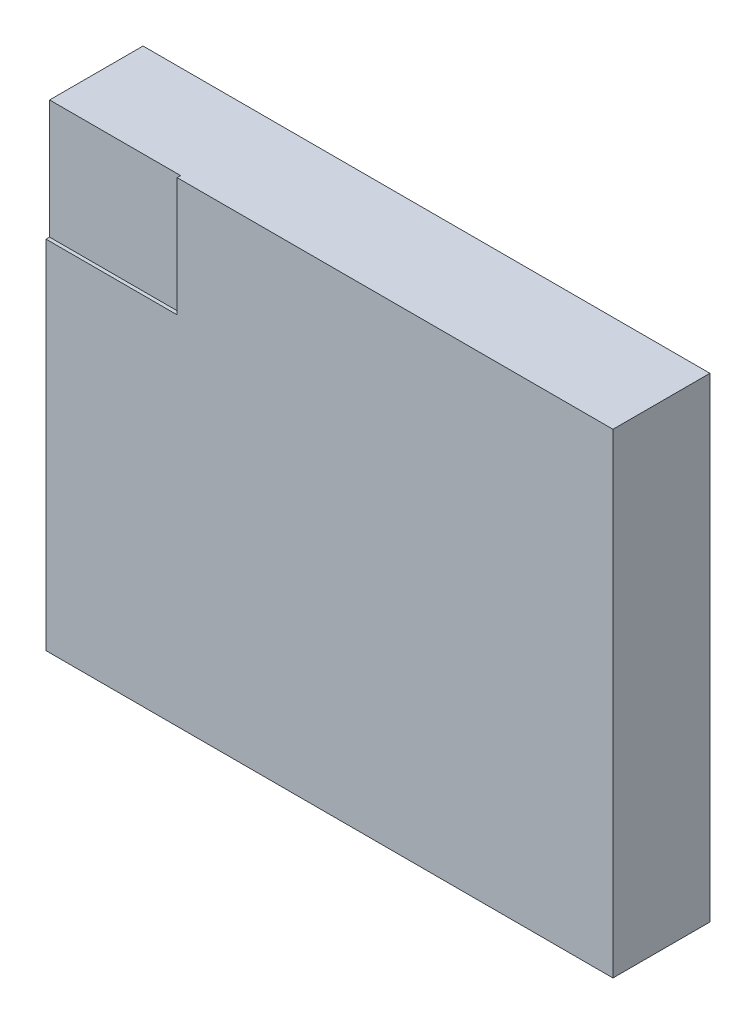
ISO-10303-21;
HEADER;
FILE_DESCRIPTION(('STEP AP214'),'2;1');
FILE_NAME('part.step','',(''),(''),'','','');
FILE_SCHEMA(('AUTOMOTIVE_DESIGN { 1 0 10303 214 1 1 1 1 }'));
ENDSEC;
DATA;
#1=APPLICATION_CONTEXT('core data for automotive mechanical design processes');
#2=APPLICATION_PROTOCOL_DEFINITION('international standard','automotive_design',2000,#1);
#3=PRODUCT_CONTEXT('',#1,'mechanical');
#4=PRODUCT('Part','Part','',(#3));
#5=PRODUCT_RELATED_PRODUCT_CATEGORY('part','',(#4));
#6=PRODUCT_DEFINITION_FORMATION('','',#4);
#7=PRODUCT_DEFINITION_CONTEXT('part definition',#1,'design');
#8=PRODUCT_DEFINITION('design','',#6,#7);
#9=PRODUCT_DEFINITION_SHAPE('','',#8);
#10=(LENGTH_UNIT() NAMED_UNIT(*) SI_UNIT(.MILLI.,.METRE.));
#11=(NAMED_UNIT(*) PLANE_ANGLE_UNIT() SI_UNIT($,.RADIAN.));
#12=(NAMED_UNIT(*) SI_UNIT($,.STERADIAN.) SOLID_ANGLE_UNIT());
#13=UNCERTAINTY_MEASURE_WITH_UNIT(LENGTH_MEASURE(1.E-05),#10,'distance_accuracy_value','');
#14=(GEOMETRIC_REPRESENTATION_CONTEXT(3) GLOBAL_UNCERTAINTY_ASSIGNED_CONTEXT((#13)) GLOBAL_UNIT_ASSIGNED_CONTEXT((#10,
#11,#12)) REPRESENTATION_CONTEXT('',''));
#15=CARTESIAN_POINT('',(0.,0.,0.));
#16=DIRECTION('',(0.,0.,1.));
#17=DIRECTION('',(1.,0.,0.));
#18=AXIS2_PLACEMENT_3D('',#15,#16,#17);
#19=CARTESIAN_POINT('',(-0.804,-0.674,0.439));
#20=DIRECTION('',(0.,1.,0.));
#21=DIRECTION('',(0.,0.,1.));
#22=AXIS2_PLACEMENT_3D('',#19,#20,#21);
#23=PLANE('',#22);
#24=DIRECTION('',(1.,0.,0.));
#25=VECTOR('',#24,1.);
#26=CARTESIAN_POINT('',(-0.804,-0.674,0.164));
#27=LINE('',#26,#25);
#28=CARTESIAN_POINT('',(-0.804,-0.674,0.164));
#29=VERTEX_POINT('',#28);
#30=CARTESIAN_POINT('',(0.804,-0.674,0.164));
#31=VERTEX_POINT('',#30);
#32=EDGE_CURVE('E153',#29,#31,#27,.T.);
#33=ORIENTED_EDGE('',*,*,#32,.T.);
#34=DIRECTION('',(0.,0.,-1.));
#35=VECTOR('',#34,1.);
#36=CARTESIAN_POINT('',(0.804,-0.674,0.439));
#37=LINE('',#36,#35);
#38=CARTESIAN_POINT('',(0.804,-0.674,0.439));
#39=VERTEX_POINT('',#38);
#40=EDGE_CURVE('E175',#39,#31,#37,.T.);
#41=ORIENTED_EDGE('',*,*,#40,.F.);
#42=DIRECTION('',(1.,0.,0.));
#43=VECTOR('',#42,1.);
#44=CARTESIAN_POINT('',(-0.804,-0.674,0.439));
#45=LINE('',#44,#43);
#46=CARTESIAN_POINT('',(-0.804,-0.674,0.439));
#47=VERTEX_POINT('',#46);
#48=EDGE_CURVE('E142',#47,#39,#45,.T.);
#49=ORIENTED_EDGE('',*,*,#48,.F.);
#50=DIRECTION('',(0.,0.,-1.));
#51=VECTOR('',#50,1.);
#52=CARTESIAN_POINT('',(-0.804,-0.674,0.439));
#53=LINE('',#52,#51);
#54=EDGE_CURVE('E65',#47,#29,#53,.T.);
#55=ORIENTED_EDGE('',*,*,#54,.T.);
#56=EDGE_LOOP('',(#33,#41,#49,#55));
#57=FACE_BOUND('',#56,.T.);
#58=ADVANCED_FACE('F41',(#57),#23,.F.);
#59=CARTESIAN_POINT('',(0.804,-0.674,0.439));
#60=DIRECTION('',(-1.,0.,0.));
#61=DIRECTION('',(0.,0.,1.));
#62=AXIS2_PLACEMENT_3D('',#59,#60,#61);
#63=PLANE('',#62);
#64=DIRECTION('',(0.,1.,0.));
#65=VECTOR('',#64,1.);
#66=CARTESIAN_POINT('',(0.804,-0.674,0.164));
#67=LINE('',#66,#65);
#68=CARTESIAN_POINT('',(0.804,0.674,0.164));
#69=VERTEX_POINT('',#68);
#70=EDGE_CURVE('E156',#31,#69,#67,.T.);
#71=ORIENTED_EDGE('',*,*,#70,.T.);
#72=DIRECTION('',(0.,0.,-1.));
#73=VECTOR('',#72,1.);
#74=CARTESIAN_POINT('',(0.804,0.674,0.439));
#75=LINE('',#74,#73);
#76=CARTESIAN_POINT('',(0.804,0.674,0.439));
#77=VERTEX_POINT('',#76);
#78=EDGE_CURVE('E172',#77,#69,#75,.T.);
#79=ORIENTED_EDGE('',*,*,#78,.F.);
#80=DIRECTION('',(0.,1.,0.));
#81=VECTOR('',#80,1.);
#82=CARTESIAN_POINT('',(0.804,-0.674,0.439));
#83=LINE('',#82,#81);
#84=EDGE_CURVE('E90',#39,#77,#83,.T.);
#85=ORIENTED_EDGE('',*,*,#84,.F.);
#86=ORIENTED_EDGE('',*,*,#40,.T.);
#87=EDGE_LOOP('',(#71,#79,#85,#86));
#88=FACE_BOUND('',#87,.T.);
#89=ADVANCED_FACE('F231',(#88),#63,.F.);
#90=CARTESIAN_POINT('',(-0.804,0.674,0.439));
#91=DIRECTION('',(0.,1.,0.));
#92=DIRECTION('',(0.,0.,1.));
#93=AXIS2_PLACEMENT_3D('',#90,#91,#92);
#94=PLANE('',#93);
#95=DIRECTION('',(0.,0.,1.));
#96=VECTOR('',#95,1.);
#97=CARTESIAN_POINT('',(-0.432193105170204,0.674,0.429));
#98=LINE('',#97,#96);
#99=CARTESIAN_POINT('',(-0.432193105170204,0.674,0.429));
#100=VERTEX_POINT('',#99);
#101=CARTESIAN_POINT('',(-0.432193105170204,0.674,0.439));
#102=VERTEX_POINT('',#101);
#103=EDGE_CURVE('E136',#100,#102,#98,.T.);
#104=ORIENTED_EDGE('',*,*,#103,.T.);
#105=DIRECTION('',(1.,0.,0.));
#106=VECTOR('',#105,1.);
#107=CARTESIAN_POINT('',(-0.804,0.674,0.439));
#108=LINE('',#107,#106);
#109=EDGE_CURVE('E148',#102,#77,#108,.T.);
#110=ORIENTED_EDGE('',*,*,#109,.T.);
#111=ORIENTED_EDGE('',*,*,#78,.T.);
#112=DIRECTION('',(1.,0.,0.));
#113=VECTOR('',#112,1.);
#114=CARTESIAN_POINT('',(-0.804,0.674,0.164));
#115=LINE('',#114,#113);
#116=CARTESIAN_POINT('',(-0.804,0.674,0.164));
#117=VERTEX_POINT('',#116);
#118=EDGE_CURVE('E160',#117,#69,#115,.T.);
#119=ORIENTED_EDGE('',*,*,#118,.F.);
#120=DIRECTION('',(0.,0.,-1.));
#121=VECTOR('',#120,1.);
#122=CARTESIAN_POINT('',(-0.804,0.674,0.439));
#123=LINE('',#122,#121);
#124=CARTESIAN_POINT('',(-0.804,0.674,0.429));
#125=VERTEX_POINT('',#124);
#126=EDGE_CURVE('E169',#125,#117,#123,.T.);
#127=ORIENTED_EDGE('',*,*,#126,.F.);
#128=DIRECTION('',(-1.,0.,0.));
#129=VECTOR('',#128,1.);
#130=CARTESIAN_POINT('',(-0.804,0.674,0.429));
#131=LINE('',#130,#129);
#132=EDGE_CURVE('E123',#100,#125,#131,.T.);
#133=ORIENTED_EDGE('',*,*,#132,.F.);
#134=EDGE_LOOP('',(#104,#110,#111,#119,#127,#133));
#135=FACE_BOUND('',#134,.T.);
#136=ADVANCED_FACE('F229',(#135),#94,.T.);
#137=CARTESIAN_POINT('',(-0.804,-0.674,0.439));
#138=DIRECTION('',(-1.,0.,0.));
#139=DIRECTION('',(0.,0.,1.));
#140=AXIS2_PLACEMENT_3D('',#137,#138,#139);
#141=PLANE('',#140);
#142=DIRECTION('',(0.,0.,1.));
#143=VECTOR('',#142,1.);
#144=CARTESIAN_POINT('',(-0.804,0.336964115895415,0.429));
#145=LINE('',#144,#143);
#146=CARTESIAN_POINT('',(-0.804,0.336964115895415,0.429));
#147=VERTEX_POINT('',#146);
#148=CARTESIAN_POINT('',(-0.804,0.336964115895415,0.439));
#149=VERTEX_POINT('',#148);
#150=EDGE_CURVE('E56',#147,#149,#145,.T.);
#151=ORIENTED_EDGE('',*,*,#150,.F.);
#152=DIRECTION('',(0.,-1.,0.));
#153=VECTOR('',#152,1.);
#154=CARTESIAN_POINT('',(-0.804,0.674,0.429));
#155=LINE('',#154,#153);
#156=EDGE_CURVE('E118',#125,#147,#155,.T.);
#157=ORIENTED_EDGE('',*,*,#156,.F.);
#158=ORIENTED_EDGE('',*,*,#126,.T.);
#159=DIRECTION('',(0.,1.,0.));
#160=VECTOR('',#159,1.);
#161=CARTESIAN_POINT('',(-0.804,-0.674,0.164));
#162=LINE('',#161,#160);
#163=EDGE_CURVE('E145',#29,#117,#162,.T.);
#164=ORIENTED_EDGE('',*,*,#163,.F.);
#165=ORIENTED_EDGE('',*,*,#54,.F.);
#166=DIRECTION('',(0.,1.,0.));
#167=VECTOR('',#166,1.);
#168=CARTESIAN_POINT('',(-0.804,-0.674,0.439));
#169=LINE('',#168,#167);
#170=EDGE_CURVE('E130',#47,#149,#169,.T.);
#171=ORIENTED_EDGE('',*,*,#170,.T.);
#172=EDGE_LOOP('',(#151,#157,#158,#164,#165,#171));
#173=FACE_BOUND('',#172,.T.);
#174=ADVANCED_FACE('F128',(#173),#141,.T.);
#175=CARTESIAN_POINT('',(0.,0.,0.439));
#176=DIRECTION('',(0.,0.,1.));
#177=DIRECTION('',(1.,0.,0.));
#178=AXIS2_PLACEMENT_3D('',#175,#176,#177);
#179=PLANE('',#178);
#180=DIRECTION('',(0.,1.,0.));
#181=VECTOR('',#180,1.);
#182=CARTESIAN_POINT('',(-0.432193105170204,0.674,0.439));
#183=LINE('',#182,#181);
#184=CARTESIAN_POINT('',(-0.432193105170204,0.336964115895415,0.439));
#185=VERTEX_POINT('',#184);
#186=EDGE_CURVE('E126',#185,#102,#183,.T.);
#187=ORIENTED_EDGE('',*,*,#186,.F.);
#188=DIRECTION('',(1.,0.,0.));
#189=VECTOR('',#188,1.);
#190=CARTESIAN_POINT('',(-0.804,0.336964115895415,0.439));
#191=LINE('',#190,#189);
#192=EDGE_CURVE('E234',#149,#185,#191,.T.);
#193=ORIENTED_EDGE('',*,*,#192,.F.);
#194=ORIENTED_EDGE('',*,*,#170,.F.);
#195=ORIENTED_EDGE('',*,*,#48,.T.);
#196=ORIENTED_EDGE('',*,*,#84,.T.);
#197=ORIENTED_EDGE('',*,*,#109,.F.);
#198=EDGE_LOOP('',(#187,#193,#194,#195,#196,#197));
#199=FACE_BOUND('',#198,.T.);
#200=ADVANCED_FACE('F210',(#199),#179,.T.);
#201=CARTESIAN_POINT('',(0.,0.,0.164));
#202=DIRECTION('',(0.,0.,1.));
#203=DIRECTION('',(1.,0.,0.));
#204=AXIS2_PLACEMENT_3D('',#201,#202,#203);
#205=PLANE('',#204);
#206=CARTESIAN_POINT('',(0.35,0.4,0.164));
#207=DIRECTION('',(0.,0.,1.));
#208=DIRECTION('',(1.,0.,0.));
#209=AXIS2_PLACEMENT_3D('',#206,#207,#208);
#210=CIRCLE('',#209,0.0905538513813742);
#211=CARTESIAN_POINT('',(0.440553851381374,0.4,0.164));
#212=VERTEX_POINT('',#211);
#213=EDGE_CURVE('E11',#212,#212,#210,.F.);
#214=ORIENTED_EDGE('',*,*,#213,.F.);
#215=EDGE_LOOP('',(#214));
#216=FACE_BOUND('',#215,.T.);
#217=CARTESIAN_POINT('',(0.35,-0.4,0.164));
#218=DIRECTION('',(0.,0.,1.));
#219=DIRECTION('',(1.,0.,0.));
#220=AXIS2_PLACEMENT_3D('',#217,#218,#219);
#221=CIRCLE('',#220,0.0905538513813742);
#222=CARTESIAN_POINT('',(0.440553851381374,-0.4,0.164));
#223=VERTEX_POINT('',#222);
#224=EDGE_CURVE('E49',#223,#223,#221,.F.);
#225=ORIENTED_EDGE('',*,*,#224,.F.);
#226=EDGE_LOOP('',(#225));
#227=FACE_BOUND('',#226,.T.);
#228=CARTESIAN_POINT('',(0.35,0.,0.164));
#229=DIRECTION('',(0.,0.,1.));
#230=DIRECTION('',(1.,0.,0.));
#231=AXIS2_PLACEMENT_3D('',#228,#229,#230);
#232=CIRCLE('',#231,0.0905538513813742);
#233=CARTESIAN_POINT('',(0.440553851381374,0.,0.164));
#234=VERTEX_POINT('',#233);
#235=EDGE_CURVE('E198',#234,#234,#232,.F.);
#236=ORIENTED_EDGE('',*,*,#235,.F.);
#237=EDGE_LOOP('',(#236));
#238=FACE_BOUND('',#237,.T.);
#239=CARTESIAN_POINT('',(0.,-0.2,0.164));
#240=DIRECTION('',(0.,0.,1.));
#241=DIRECTION('',(1.,0.,0.));
#242=AXIS2_PLACEMENT_3D('',#239,#240,#241);
#243=CIRCLE('',#242,0.0905538513813742);
#244=CARTESIAN_POINT('',(0.0905538513813742,-0.2,0.164));
#245=VERTEX_POINT('',#244);
#246=EDGE_CURVE('E194',#245,#245,#243,.F.);
#247=ORIENTED_EDGE('',*,*,#246,.F.);
#248=EDGE_LOOP('',(#247));
#249=FACE_BOUND('',#248,.T.);
#250=CARTESIAN_POINT('',(0.,0.2,0.164));
#251=DIRECTION('',(0.,0.,1.));
#252=DIRECTION('',(1.,0.,0.));
#253=AXIS2_PLACEMENT_3D('',#250,#251,#252);
#254=CIRCLE('',#253,0.0905538513813742);
#255=CARTESIAN_POINT('',(0.0905538513813742,0.2,0.164));
#256=VERTEX_POINT('',#255);
#257=EDGE_CURVE('E190',#256,#256,#254,.F.);
#258=ORIENTED_EDGE('',*,*,#257,.F.);
#259=EDGE_LOOP('',(#258));
#260=FACE_BOUND('',#259,.T.);
#261=CARTESIAN_POINT('',(-0.35,0.4,0.164));
#262=DIRECTION('',(0.,0.,1.));
#263=DIRECTION('',(1.,0.,0.));
#264=AXIS2_PLACEMENT_3D('',#261,#262,#263);
#265=CIRCLE('',#264,0.0905538513813742);
#266=CARTESIAN_POINT('',(-0.259446148618626,0.4,0.164));
#267=VERTEX_POINT('',#266);
#268=EDGE_CURVE('E186',#267,#267,#265,.F.);
#269=ORIENTED_EDGE('',*,*,#268,.F.);
#270=EDGE_LOOP('',(#269));
#271=FACE_BOUND('',#270,.T.);
#272=CARTESIAN_POINT('',(-0.35,-0.4,0.164));
#273=DIRECTION('',(0.,0.,1.));
#274=DIRECTION('',(1.,0.,0.));
#275=AXIS2_PLACEMENT_3D('',#272,#273,#274);
#276=CIRCLE('',#275,0.0905538513813742);
#277=CARTESIAN_POINT('',(-0.259446148618626,-0.4,0.164));
#278=VERTEX_POINT('',#277);
#279=EDGE_CURVE('E182',#278,#278,#276,.F.);
#280=ORIENTED_EDGE('',*,*,#279,.F.);
#281=EDGE_LOOP('',(#280));
#282=FACE_BOUND('',#281,.T.);
#283=CARTESIAN_POINT('',(-0.35,0.,0.164));
#284=DIRECTION('',(0.,0.,1.));
#285=DIRECTION('',(1.,0.,0.));
#286=AXIS2_PLACEMENT_3D('',#283,#284,#285);
#287=CIRCLE('',#286,0.0905538513813742);
#288=CARTESIAN_POINT('',(-0.259446148618626,0.,0.164));
#289=VERTEX_POINT('',#288);
#290=EDGE_CURVE('E178',#289,#289,#287,.F.);
#291=ORIENTED_EDGE('',*,*,#290,.F.);
#292=EDGE_LOOP('',(#291));
#293=FACE_BOUND('',#292,.T.);
#294=ORIENTED_EDGE('',*,*,#32,.F.);
#295=ORIENTED_EDGE('',*,*,#163,.T.);
#296=ORIENTED_EDGE('',*,*,#118,.T.);
#297=ORIENTED_EDGE('',*,*,#70,.F.);
#298=EDGE_LOOP('',(#294,#295,#296,#297));
#299=FACE_BOUND('',#298,.T.);
#300=ADVANCED_FACE('F206',(#216,#227,#238,#249,#260,#271,#282,#293,#299),#205,.F.);
#301=CARTESIAN_POINT('',(-0.432193105170204,0.674,0.429));
#302=DIRECTION('',(1.,0.,0.));
#303=DIRECTION('',(0.,0.,-1.));
#304=AXIS2_PLACEMENT_3D('',#301,#302,#303);
#305=PLANE('',#304);
#306=ORIENTED_EDGE('',*,*,#186,.T.);
#307=ORIENTED_EDGE('',*,*,#103,.F.);
#308=DIRECTION('',(0.,1.,0.));
#309=VECTOR('',#308,1.);
#310=CARTESIAN_POINT('',(-0.432193105170204,0.674,0.429));
#311=LINE('',#310,#309);
#312=CARTESIAN_POINT('',(-0.432193105170204,0.336964115895415,0.429));
#313=VERTEX_POINT('',#312);
#314=EDGE_CURVE('E117',#313,#100,#311,.T.);
#315=ORIENTED_EDGE('',*,*,#314,.F.);
#316=DIRECTION('',(0.,0.,1.));
#317=VECTOR('',#316,1.);
#318=CARTESIAN_POINT('',(-0.432193105170204,0.336964115895415,0.429));
#319=LINE('',#318,#317);
#320=EDGE_CURVE('E112',#313,#185,#319,.T.);
#321=ORIENTED_EDGE('',*,*,#320,.T.);
#322=EDGE_LOOP('',(#306,#307,#315,#321));
#323=FACE_BOUND('',#322,.T.);
#324=ADVANCED_FACE('F209',(#323),#305,.F.);
#325=CARTESIAN_POINT('',(-0.804,0.336964115895415,0.429));
#326=DIRECTION('',(0.,-1.,0.));
#327=DIRECTION('',(0.,0.,-1.));
#328=AXIS2_PLACEMENT_3D('',#325,#326,#327);
#329=PLANE('',#328);
#330=ORIENTED_EDGE('',*,*,#192,.T.);
#331=ORIENTED_EDGE('',*,*,#320,.F.);
#332=DIRECTION('',(1.,0.,0.));
#333=VECTOR('',#332,1.);
#334=CARTESIAN_POINT('',(-0.804,0.336964115895415,0.429));
#335=LINE('',#334,#333);
#336=EDGE_CURVE('E109',#147,#313,#335,.T.);
#337=ORIENTED_EDGE('',*,*,#336,.F.);
#338=ORIENTED_EDGE('',*,*,#150,.T.);
#339=EDGE_LOOP('',(#330,#331,#337,#338));
#340=FACE_BOUND('',#339,.T.);
#341=ADVANCED_FACE('F111',(#340),#329,.F.);
#342=CARTESIAN_POINT('',(0.,0.,0.429));
#343=DIRECTION('',(0.,0.,1.));
#344=DIRECTION('',(1.,0.,0.));
#345=AXIS2_PLACEMENT_3D('',#342,#343,#344);
#346=PLANE('',#345);
#347=ORIENTED_EDGE('',*,*,#156,.T.);
#348=ORIENTED_EDGE('',*,*,#336,.T.);
#349=ORIENTED_EDGE('',*,*,#314,.T.);
#350=ORIENTED_EDGE('',*,*,#132,.T.);
#351=EDGE_LOOP('',(#347,#348,#349,#350));
#352=FACE_BOUND('',#351,.T.);
#353=ADVANCED_FACE('F121',(#352),#346,.T.);
#354=CARTESIAN_POINT('',(-0.35,0.,0.107));
#355=DIRECTION('',(0.,0.,-1.));
#356=DIRECTION('',(1.,0.,0.));
#357=AXIS2_PLACEMENT_3D('',#354,#355,#356);
#358=SPHERICAL_SURFACE('',#357,0.107);
#359=ORIENTED_EDGE('',*,*,#290,.T.);
#360=EDGE_LOOP('',(#359));
#361=FACE_BOUND('',#360,.T.);
#362=ADVANCED_FACE('F285',(#361),#358,.T.);
#363=CARTESIAN_POINT('',(-0.35,-0.4,0.107));
#364=DIRECTION('',(0.,0.,-1.));
#365=DIRECTION('',(1.,0.,0.));
#366=AXIS2_PLACEMENT_3D('',#363,#364,#365);
#367=SPHERICAL_SURFACE('',#366,0.107);
#368=ORIENTED_EDGE('',*,*,#279,.T.);
#369=EDGE_LOOP('',(#368));
#370=FACE_BOUND('',#369,.T.);
#371=ADVANCED_FACE('F292',(#370),#367,.T.);
#372=CARTESIAN_POINT('',(-0.35,0.4,0.107));
#373=DIRECTION('',(0.,0.,-1.));
#374=DIRECTION('',(1.,0.,0.));
#375=AXIS2_PLACEMENT_3D('',#372,#373,#374);
#376=SPHERICAL_SURFACE('',#375,0.107);
#377=ORIENTED_EDGE('',*,*,#268,.T.);
#378=EDGE_LOOP('',(#377));
#379=FACE_BOUND('',#378,.T.);
#380=ADVANCED_FACE('F301',(#379),#376,.T.);
#381=CARTESIAN_POINT('',(0.,0.2,0.107));
#382=DIRECTION('',(0.,0.,-1.));
#383=DIRECTION('',(1.,0.,0.));
#384=AXIS2_PLACEMENT_3D('',#381,#382,#383);
#385=SPHERICAL_SURFACE('',#384,0.107);
#386=ORIENTED_EDGE('',*,*,#257,.T.);
#387=EDGE_LOOP('',(#386));
#388=FACE_BOUND('',#387,.T.);
#389=ADVANCED_FACE('F310',(#388),#385,.T.);
#390=CARTESIAN_POINT('',(0.,-0.2,0.107));
#391=DIRECTION('',(0.,0.,-1.));
#392=DIRECTION('',(1.,0.,0.));
#393=AXIS2_PLACEMENT_3D('',#390,#391,#392);
#394=SPHERICAL_SURFACE('',#393,0.107);
#395=ORIENTED_EDGE('',*,*,#246,.T.);
#396=EDGE_LOOP('',(#395));
#397=FACE_BOUND('',#396,.T.);
#398=ADVANCED_FACE('F319',(#397),#394,.T.);
#399=CARTESIAN_POINT('',(0.35,0.,0.107));
#400=DIRECTION('',(0.,0.,-1.));
#401=DIRECTION('',(-1.,0.,0.));
#402=AXIS2_PLACEMENT_3D('',#399,#400,#401);
#403=SPHERICAL_SURFACE('',#402,0.107);
#404=ORIENTED_EDGE('',*,*,#235,.T.);
#405=EDGE_LOOP('',(#404));
#406=FACE_BOUND('',#405,.T.);
#407=ADVANCED_FACE('F327',(#406),#403,.T.);
#408=CARTESIAN_POINT('',(0.35,-0.4,0.107));
#409=DIRECTION('',(0.,0.,-1.));
#410=DIRECTION('',(-1.,0.,0.));
#411=AXIS2_PLACEMENT_3D('',#408,#409,#410);
#412=SPHERICAL_SURFACE('',#411,0.107);
#413=ORIENTED_EDGE('',*,*,#224,.T.);
#414=EDGE_LOOP('',(#413));
#415=FACE_BOUND('',#414,.T.);
#416=ADVANCED_FACE('F204',(#415),#412,.T.);
#417=CARTESIAN_POINT('',(0.35,0.4,0.107));
#418=DIRECTION('',(0.,0.,-1.));
#419=DIRECTION('',(-1.,0.,0.));
#420=AXIS2_PLACEMENT_3D('',#417,#418,#419);
#421=SPHERICAL_SURFACE('',#420,0.107);
#422=ORIENTED_EDGE('',*,*,#213,.T.);
#423=EDGE_LOOP('',(#422));
#424=FACE_BOUND('',#423,.T.);
#425=ADVANCED_FACE('F343',(#424),#421,.T.);
#426=CLOSED_SHELL('',(#58,#89,#136,#174,#200,#300,#324,#341,#353,#362,#371,#380,#389,#398,#407,
#416,#425));
#427=MANIFOLD_SOLID_BREP('B2',#426);
#428=ADVANCED_BREP_SHAPE_REPRESENTATION('',(#18,#427),#14);
#429=SHAPE_DEFINITION_REPRESENTATION(#9,#428);
ENDSEC;
END-ISO-10303-21;
